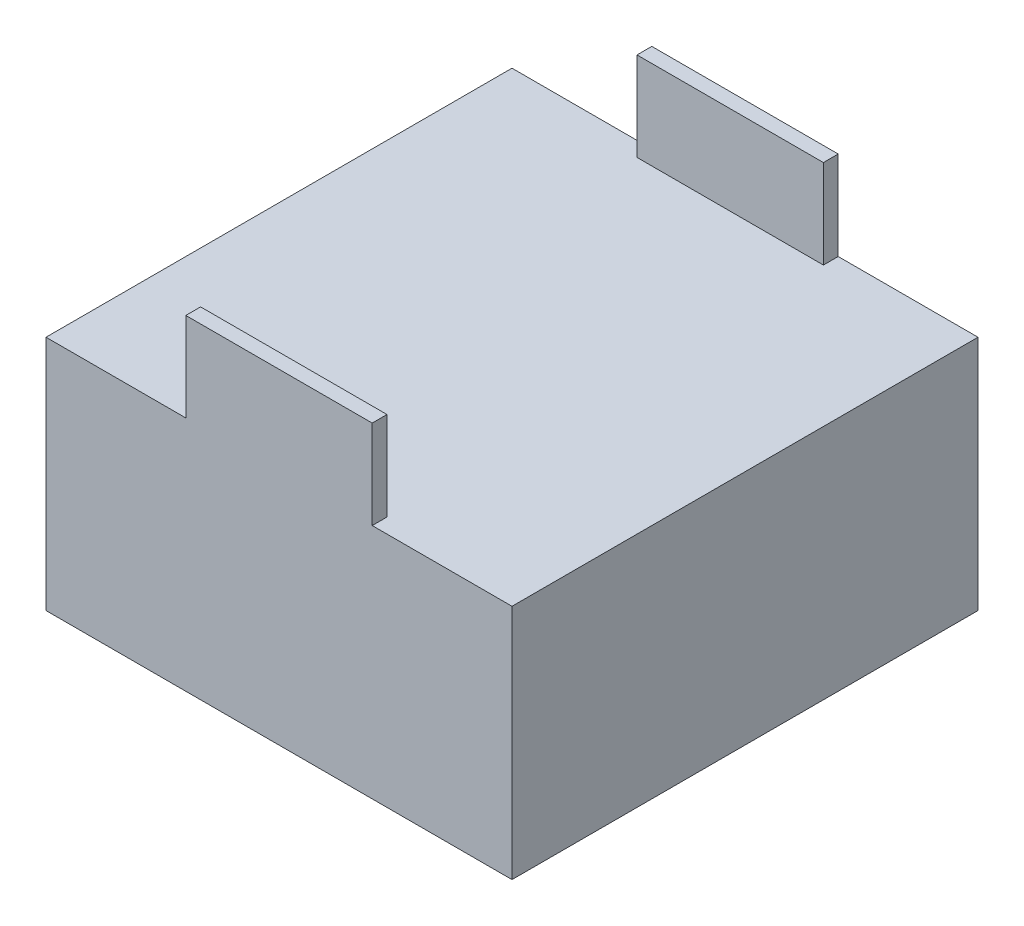
ISO-10303-21;
HEADER;
FILE_DESCRIPTION(('STEP AP214'),'2;1');
FILE_NAME('part.step','',(''),(''),'','','');
FILE_SCHEMA(('AUTOMOTIVE_DESIGN { 1 0 10303 214 1 1 1 1 }'));
ENDSEC;
DATA;
#1=APPLICATION_CONTEXT('core data for automotive mechanical design processes');
#2=APPLICATION_PROTOCOL_DEFINITION('international standard','automotive_design',2000,#1);
#3=PRODUCT_CONTEXT('',#1,'mechanical');
#4=PRODUCT('Part','Part','',(#3));
#5=PRODUCT_RELATED_PRODUCT_CATEGORY('part','',(#4));
#6=PRODUCT_DEFINITION_FORMATION('','',#4);
#7=PRODUCT_DEFINITION_CONTEXT('part definition',#1,'design');
#8=PRODUCT_DEFINITION('design','',#6,#7);
#9=PRODUCT_DEFINITION_SHAPE('','',#8);
#10=(LENGTH_UNIT() NAMED_UNIT(*) SI_UNIT(.MILLI.,.METRE.));
#11=(NAMED_UNIT(*) PLANE_ANGLE_UNIT() SI_UNIT($,.RADIAN.));
#12=(NAMED_UNIT(*) SI_UNIT($,.STERADIAN.) SOLID_ANGLE_UNIT());
#13=UNCERTAINTY_MEASURE_WITH_UNIT(LENGTH_MEASURE(1.E-05),#10,'distance_accuracy_value','');
#14=(GEOMETRIC_REPRESENTATION_CONTEXT(3) GLOBAL_UNCERTAINTY_ASSIGNED_CONTEXT((#13)) GLOBAL_UNIT_ASSIGNED_CONTEXT((#10,
#11,#12)) REPRESENTATION_CONTEXT('',''));
#15=CARTESIAN_POINT('',(0.,0.,0.));
#16=DIRECTION('',(0.,0.,1.));
#17=DIRECTION('',(1.,0.,0.));
#18=AXIS2_PLACEMENT_3D('',#15,#16,#17);
#19=CARTESIAN_POINT('',(0.,25.4,0.));
#20=DIRECTION('',(0.,-1.,0.));
#21=DIRECTION('',(0.,0.,-1.));
#22=AXIS2_PLACEMENT_3D('',#19,#20,#21);
#23=PLANE('',#22);
#24=DIRECTION('',(0.,0.,1.));
#25=VECTOR('',#24,1.);
#26=CARTESIAN_POINT('',(14.9999446,25.4,-49.9999));
#27=LINE('',#26,#25);
#28=CARTESIAN_POINT('',(14.9999446,25.4,-49.9999));
#29=VERTEX_POINT('',#28);
#30=CARTESIAN_POINT('',(14.9999446,25.4,-48.4124));
#31=VERTEX_POINT('',#30);
#32=EDGE_CURVE('E223',#29,#31,#27,.T.);
#33=ORIENTED_EDGE('',*,*,#32,.F.);
#34=DIRECTION('',(-1.,0.,0.));
#35=VECTOR('',#34,1.);
#36=CARTESIAN_POINT('',(0.,25.4,-49.9999));
#37=LINE('',#36,#35);
#38=CARTESIAN_POINT('',(0.,25.4,-49.9999));
#39=VERTEX_POINT('',#38);
#40=EDGE_CURVE('E146',#29,#39,#37,.T.);
#41=ORIENTED_EDGE('',*,*,#40,.T.);
#42=DIRECTION('',(0.,0.,1.));
#43=VECTOR('',#42,1.);
#44=CARTESIAN_POINT('',(0.,25.4,0.));
#45=LINE('',#44,#43);
#46=CARTESIAN_POINT('',(0.,25.4,0.));
#47=VERTEX_POINT('',#46);
#48=EDGE_CURVE('E174',#39,#47,#45,.T.);
#49=ORIENTED_EDGE('',*,*,#48,.T.);
#50=DIRECTION('',(1.,0.,0.));
#51=VECTOR('',#50,1.);
#52=CARTESIAN_POINT('',(0.,25.4,0.));
#53=LINE('',#52,#51);
#54=CARTESIAN_POINT('',(14.9999446,25.4,0.));
#55=VERTEX_POINT('',#54);
#56=EDGE_CURVE('E187',#47,#55,#53,.T.);
#57=ORIENTED_EDGE('',*,*,#56,.T.);
#58=DIRECTION('',(0.,0.,1.));
#59=VECTOR('',#58,1.);
#60=CARTESIAN_POINT('',(14.9999446,25.4,0.));
#61=LINE('',#60,#59);
#62=CARTESIAN_POINT('',(14.9999446,25.4,-1.5875));
#63=VERTEX_POINT('',#62);
#64=EDGE_CURVE('E37',#63,#55,#61,.T.);
#65=ORIENTED_EDGE('',*,*,#64,.F.);
#66=DIRECTION('',(-1.,0.,0.));
#67=VECTOR('',#66,1.);
#68=CARTESIAN_POINT('',(14.9999446,25.4,-1.5875));
#69=LINE('',#68,#67);
#70=CARTESIAN_POINT('',(34.9999554,25.4,-1.5875));
#71=VERTEX_POINT('',#70);
#72=EDGE_CURVE('E158',#71,#63,#69,.T.);
#73=ORIENTED_EDGE('',*,*,#72,.F.);
#74=DIRECTION('',(0.,0.,-1.));
#75=VECTOR('',#74,1.);
#76=CARTESIAN_POINT('',(34.9999554,25.4,0.));
#77=LINE('',#76,#75);
#78=CARTESIAN_POINT('',(34.9999554,25.4,0.));
#79=VERTEX_POINT('',#78);
#80=EDGE_CURVE('E149',#79,#71,#77,.T.);
#81=ORIENTED_EDGE('',*,*,#80,.F.);
#82=CARTESIAN_POINT('',(49.9999,25.4,0.));
#83=VERTEX_POINT('',#82);
#84=EDGE_CURVE('E177',#79,#83,#53,.T.);
#85=ORIENTED_EDGE('',*,*,#84,.T.);
#86=DIRECTION('',(0.,0.,-1.));
#87=VECTOR('',#86,1.);
#88=CARTESIAN_POINT('',(49.9999,25.4,0.));
#89=LINE('',#88,#87);
#90=CARTESIAN_POINT('',(49.9999,25.4,-49.9999));
#91=VERTEX_POINT('',#90);
#92=EDGE_CURVE('E181',#83,#91,#89,.T.);
#93=ORIENTED_EDGE('',*,*,#92,.T.);
#94=CARTESIAN_POINT('',(34.9999554,25.4,-49.9999));
#95=VERTEX_POINT('',#94);
#96=EDGE_CURVE('E197',#91,#95,#37,.T.);
#97=ORIENTED_EDGE('',*,*,#96,.T.);
#98=DIRECTION('',(0.,0.,-1.));
#99=VECTOR('',#98,1.);
#100=CARTESIAN_POINT('',(34.9999554,25.4,-49.9999));
#101=LINE('',#100,#99);
#102=CARTESIAN_POINT('',(34.9999554,25.4,-48.4124));
#103=VERTEX_POINT('',#102);
#104=EDGE_CURVE('E56',#103,#95,#101,.T.);
#105=ORIENTED_EDGE('',*,*,#104,.F.);
#106=DIRECTION('',(1.,0.,0.));
#107=VECTOR('',#106,1.);
#108=CARTESIAN_POINT('',(14.9999446,25.4,-48.4124));
#109=LINE('',#108,#107);
#110=EDGE_CURVE('E51',#31,#103,#109,.T.);
#111=ORIENTED_EDGE('',*,*,#110,.F.);
#112=EDGE_LOOP('',(#33,#41,#49,#57,#65,#73,#81,#85,#93,#97,#105,#111));
#113=FACE_BOUND('',#112,.T.);
#114=ADVANCED_FACE('F33',(#113),#23,.F.);
#115=CARTESIAN_POINT('',(0.,25.4,0.));
#116=DIRECTION('',(1.,0.,0.));
#117=DIRECTION('',(0.,0.,-1.));
#118=AXIS2_PLACEMENT_3D('',#115,#116,#117);
#119=PLANE('',#118);
#120=DIRECTION('',(0.,0.,1.));
#121=VECTOR('',#120,1.);
#122=CARTESIAN_POINT('',(0.,0.,0.));
#123=LINE('',#122,#121);
#124=CARTESIAN_POINT('',(0.,0.,-49.9999));
#125=VERTEX_POINT('',#124);
#126=CARTESIAN_POINT('',(0.,0.,0.));
#127=VERTEX_POINT('',#126);
#128=EDGE_CURVE('E203',#125,#127,#123,.T.);
#129=ORIENTED_EDGE('',*,*,#128,.T.);
#130=DIRECTION('',(0.,-1.,0.));
#131=VECTOR('',#130,1.);
#132=CARTESIAN_POINT('',(0.,25.4,0.));
#133=LINE('',#132,#131);
#134=EDGE_CURVE('E11',#47,#127,#133,.T.);
#135=ORIENTED_EDGE('',*,*,#134,.F.);
#136=ORIENTED_EDGE('',*,*,#48,.F.);
#137=DIRECTION('',(0.,-1.,0.));
#138=VECTOR('',#137,1.);
#139=CARTESIAN_POINT('',(0.,25.4,-49.9999));
#140=LINE('',#139,#138);
#141=EDGE_CURVE('E194',#39,#125,#140,.T.);
#142=ORIENTED_EDGE('',*,*,#141,.T.);
#143=EDGE_LOOP('',(#129,#135,#136,#142));
#144=FACE_BOUND('',#143,.T.);
#145=ADVANCED_FACE('F35',(#144),#119,.F.);
#146=CARTESIAN_POINT('',(0.,25.4,0.));
#147=DIRECTION('',(0.,0.,-1.));
#148=DIRECTION('',(-1.,0.,0.));
#149=AXIS2_PLACEMENT_3D('',#146,#147,#148);
#150=PLANE('',#149);
#151=DIRECTION('',(1.,0.,0.));
#152=VECTOR('',#151,1.);
#153=CARTESIAN_POINT('',(0.,0.,0.));
#154=LINE('',#153,#152);
#155=CARTESIAN_POINT('',(49.9999,0.,0.));
#156=VERTEX_POINT('',#155);
#157=EDGE_CURVE('E201',#127,#156,#154,.T.);
#158=ORIENTED_EDGE('',*,*,#157,.T.);
#159=DIRECTION('',(0.,-1.,0.));
#160=VECTOR('',#159,1.);
#161=CARTESIAN_POINT('',(49.9999,25.4,0.));
#162=LINE('',#161,#160);
#163=EDGE_CURVE('E43',#83,#156,#162,.T.);
#164=ORIENTED_EDGE('',*,*,#163,.F.);
#165=ORIENTED_EDGE('',*,*,#84,.F.);
#166=DIRECTION('',(0.,-1.,0.));
#167=VECTOR('',#166,1.);
#168=CARTESIAN_POINT('',(34.9999554,34.925,0.));
#169=LINE('',#168,#167);
#170=CARTESIAN_POINT('',(34.9999554,34.925,0.));
#171=VERTEX_POINT('',#170);
#172=EDGE_CURVE('E173',#171,#79,#169,.T.);
#173=ORIENTED_EDGE('',*,*,#172,.F.);
#174=DIRECTION('',(1.,0.,0.));
#175=VECTOR('',#174,1.);
#176=CARTESIAN_POINT('',(14.9999446,34.925,0.));
#177=LINE('',#176,#175);
#178=CARTESIAN_POINT('',(14.9999446,34.925,0.));
#179=VERTEX_POINT('',#178);
#180=EDGE_CURVE('E157',#179,#171,#177,.T.);
#181=ORIENTED_EDGE('',*,*,#180,.F.);
#182=DIRECTION('',(0.,-1.,0.));
#183=VECTOR('',#182,1.);
#184=CARTESIAN_POINT('',(14.9999446,34.925,0.));
#185=LINE('',#184,#183);
#186=EDGE_CURVE('E205',#179,#55,#185,.T.);
#187=ORIENTED_EDGE('',*,*,#186,.T.);
#188=ORIENTED_EDGE('',*,*,#56,.F.);
#189=ORIENTED_EDGE('',*,*,#134,.T.);
#190=EDGE_LOOP('',(#158,#164,#165,#173,#181,#187,#188,#189));
#191=FACE_BOUND('',#190,.T.);
#192=ADVANCED_FACE('F244',(#191),#150,.F.);
#193=CARTESIAN_POINT('',(49.9999,25.4,0.));
#194=DIRECTION('',(-1.,0.,0.));
#195=DIRECTION('',(0.,0.,1.));
#196=AXIS2_PLACEMENT_3D('',#193,#194,#195);
#197=PLANE('',#196);
#198=DIRECTION('',(0.,0.,-1.));
#199=VECTOR('',#198,1.);
#200=CARTESIAN_POINT('',(49.9999,0.,0.));
#201=LINE('',#200,#199);
#202=CARTESIAN_POINT('',(49.9999,0.,-49.9999));
#203=VERTEX_POINT('',#202);
#204=EDGE_CURVE('E199',#156,#203,#201,.T.);
#205=ORIENTED_EDGE('',*,*,#204,.T.);
#206=DIRECTION('',(0.,-1.,0.));
#207=VECTOR('',#206,1.);
#208=CARTESIAN_POINT('',(49.9999,25.4,-49.9999));
#209=LINE('',#208,#207);
#210=EDGE_CURVE('E191',#91,#203,#209,.T.);
#211=ORIENTED_EDGE('',*,*,#210,.F.);
#212=ORIENTED_EDGE('',*,*,#92,.F.);
#213=ORIENTED_EDGE('',*,*,#163,.T.);
#214=EDGE_LOOP('',(#205,#211,#212,#213));
#215=FACE_BOUND('',#214,.T.);
#216=ADVANCED_FACE('F212',(#215),#197,.F.);
#217=CARTESIAN_POINT('',(0.,25.4,-49.9999));
#218=DIRECTION('',(0.,0.,1.));
#219=DIRECTION('',(1.,0.,0.));
#220=AXIS2_PLACEMENT_3D('',#217,#218,#219);
#221=PLANE('',#220);
#222=DIRECTION('',(-1.,0.,0.));
#223=VECTOR('',#222,1.);
#224=CARTESIAN_POINT('',(0.,0.,-49.9999));
#225=LINE('',#224,#223);
#226=EDGE_CURVE('E178',#203,#125,#225,.T.);
#227=ORIENTED_EDGE('',*,*,#226,.T.);
#228=ORIENTED_EDGE('',*,*,#141,.F.);
#229=ORIENTED_EDGE('',*,*,#40,.F.);
#230=DIRECTION('',(0.,-1.,0.));
#231=VECTOR('',#230,1.);
#232=CARTESIAN_POINT('',(14.9999446,34.925,-49.9999));
#233=LINE('',#232,#231);
#234=CARTESIAN_POINT('',(14.9999446,34.925,-49.9999));
#235=VERTEX_POINT('',#234);
#236=EDGE_CURVE('E128',#235,#29,#233,.T.);
#237=ORIENTED_EDGE('',*,*,#236,.F.);
#238=DIRECTION('',(-1.,0.,0.));
#239=VECTOR('',#238,1.);
#240=CARTESIAN_POINT('',(14.9999446,34.925,-49.9999));
#241=LINE('',#240,#239);
#242=CARTESIAN_POINT('',(34.9999554,34.925,-49.9999));
#243=VERTEX_POINT('',#242);
#244=EDGE_CURVE('E134',#243,#235,#241,.T.);
#245=ORIENTED_EDGE('',*,*,#244,.F.);
#246=DIRECTION('',(0.,-1.,0.));
#247=VECTOR('',#246,1.);
#248=CARTESIAN_POINT('',(34.9999554,34.925,-49.9999));
#249=LINE('',#248,#247);
#250=EDGE_CURVE('E215',#243,#95,#249,.T.);
#251=ORIENTED_EDGE('',*,*,#250,.T.);
#252=ORIENTED_EDGE('',*,*,#96,.F.);
#253=ORIENTED_EDGE('',*,*,#210,.T.);
#254=EDGE_LOOP('',(#227,#228,#229,#237,#245,#251,#252,#253));
#255=FACE_BOUND('',#254,.T.);
#256=ADVANCED_FACE('F144',(#255),#221,.F.);
#257=CARTESIAN_POINT('',(0.,0.,0.));
#258=DIRECTION('',(0.,-1.,0.));
#259=DIRECTION('',(0.,0.,-1.));
#260=AXIS2_PLACEMENT_3D('',#257,#258,#259);
#261=PLANE('',#260);
#262=ORIENTED_EDGE('',*,*,#128,.F.);
#263=ORIENTED_EDGE('',*,*,#226,.F.);
#264=ORIENTED_EDGE('',*,*,#204,.F.);
#265=ORIENTED_EDGE('',*,*,#157,.F.);
#266=EDGE_LOOP('',(#262,#263,#264,#265));
#267=FACE_BOUND('',#266,.T.);
#268=ADVANCED_FACE('F250',(#267),#261,.T.);
#269=CARTESIAN_POINT('',(14.9999446,34.925,0.));
#270=DIRECTION('',(1.,0.,0.));
#271=DIRECTION('',(0.,0.,-1.));
#272=AXIS2_PLACEMENT_3D('',#269,#270,#271);
#273=PLANE('',#272);
#274=ORIENTED_EDGE('',*,*,#64,.T.);
#275=ORIENTED_EDGE('',*,*,#186,.F.);
#276=DIRECTION('',(0.,0.,1.));
#277=VECTOR('',#276,1.);
#278=CARTESIAN_POINT('',(14.9999446,34.925,0.));
#279=LINE('',#278,#277);
#280=CARTESIAN_POINT('',(14.9999446,34.925,-1.5875));
#281=VERTEX_POINT('',#280);
#282=EDGE_CURVE('E154',#281,#179,#279,.T.);
#283=ORIENTED_EDGE('',*,*,#282,.F.);
#284=DIRECTION('',(0.,-1.,0.));
#285=VECTOR('',#284,1.);
#286=CARTESIAN_POINT('',(14.9999446,34.925,-1.5875));
#287=LINE('',#286,#285);
#288=EDGE_CURVE('E163',#281,#63,#287,.T.);
#289=ORIENTED_EDGE('',*,*,#288,.T.);
#290=EDGE_LOOP('',(#274,#275,#283,#289));
#291=FACE_BOUND('',#290,.T.);
#292=ADVANCED_FACE('F248',(#291),#273,.F.);
#293=CARTESIAN_POINT('',(34.9999554,34.925,0.));
#294=DIRECTION('',(-1.,0.,0.));
#295=DIRECTION('',(0.,0.,1.));
#296=AXIS2_PLACEMENT_3D('',#293,#294,#295);
#297=PLANE('',#296);
#298=ORIENTED_EDGE('',*,*,#80,.T.);
#299=DIRECTION('',(0.,-1.,0.));
#300=VECTOR('',#299,1.);
#301=CARTESIAN_POINT('',(34.9999554,34.925,-1.5875));
#302=LINE('',#301,#300);
#303=CARTESIAN_POINT('',(34.9999554,34.925,-1.5875));
#304=VERTEX_POINT('',#303);
#305=EDGE_CURVE('E170',#304,#71,#302,.T.);
#306=ORIENTED_EDGE('',*,*,#305,.F.);
#307=DIRECTION('',(0.,0.,-1.));
#308=VECTOR('',#307,1.);
#309=CARTESIAN_POINT('',(34.9999554,34.925,0.));
#310=LINE('',#309,#308);
#311=EDGE_CURVE('E160',#171,#304,#310,.T.);
#312=ORIENTED_EDGE('',*,*,#311,.F.);
#313=ORIENTED_EDGE('',*,*,#172,.T.);
#314=EDGE_LOOP('',(#298,#306,#312,#313));
#315=FACE_BOUND('',#314,.T.);
#316=ADVANCED_FACE('F277',(#315),#297,.F.);
#317=CARTESIAN_POINT('',(14.9999446,34.925,-1.5875));
#318=DIRECTION('',(0.,0.,1.));
#319=DIRECTION('',(1.,0.,0.));
#320=AXIS2_PLACEMENT_3D('',#317,#318,#319);
#321=PLANE('',#320);
#322=ORIENTED_EDGE('',*,*,#72,.T.);
#323=ORIENTED_EDGE('',*,*,#288,.F.);
#324=DIRECTION('',(-1.,0.,0.));
#325=VECTOR('',#324,1.);
#326=CARTESIAN_POINT('',(14.9999446,34.925,-1.5875));
#327=LINE('',#326,#325);
#328=EDGE_CURVE('E162',#304,#281,#327,.T.);
#329=ORIENTED_EDGE('',*,*,#328,.F.);
#330=ORIENTED_EDGE('',*,*,#305,.T.);
#331=EDGE_LOOP('',(#322,#323,#329,#330));
#332=FACE_BOUND('',#331,.T.);
#333=ADVANCED_FACE('F272',(#332),#321,.F.);
#334=CARTESIAN_POINT('',(0.,34.925,0.));
#335=DIRECTION('',(0.,-1.,0.));
#336=DIRECTION('',(0.,0.,-1.));
#337=AXIS2_PLACEMENT_3D('',#334,#335,#336);
#338=PLANE('',#337);
#339=ORIENTED_EDGE('',*,*,#282,.T.);
#340=ORIENTED_EDGE('',*,*,#180,.T.);
#341=ORIENTED_EDGE('',*,*,#311,.T.);
#342=ORIENTED_EDGE('',*,*,#328,.T.);
#343=EDGE_LOOP('',(#339,#340,#341,#342));
#344=FACE_BOUND('',#343,.T.);
#345=ADVANCED_FACE('F286',(#344),#338,.F.);
#346=CARTESIAN_POINT('',(14.9999446,34.925,-49.9999));
#347=DIRECTION('',(1.,0.,0.));
#348=DIRECTION('',(0.,0.,-1.));
#349=AXIS2_PLACEMENT_3D('',#346,#347,#348);
#350=PLANE('',#349);
#351=ORIENTED_EDGE('',*,*,#32,.T.);
#352=DIRECTION('',(0.,-1.,0.));
#353=VECTOR('',#352,1.);
#354=CARTESIAN_POINT('',(14.9999446,34.925,-48.4124));
#355=LINE('',#354,#353);
#356=CARTESIAN_POINT('',(14.9999446,34.925,-48.4124));
#357=VERTEX_POINT('',#356);
#358=EDGE_CURVE('E130',#357,#31,#355,.T.);
#359=ORIENTED_EDGE('',*,*,#358,.F.);
#360=DIRECTION('',(0.,0.,1.));
#361=VECTOR('',#360,1.);
#362=CARTESIAN_POINT('',(14.9999446,34.925,-49.9999));
#363=LINE('',#362,#361);
#364=EDGE_CURVE('E124',#235,#357,#363,.T.);
#365=ORIENTED_EDGE('',*,*,#364,.F.);
#366=ORIENTED_EDGE('',*,*,#236,.T.);
#367=EDGE_LOOP('',(#351,#359,#365,#366));
#368=FACE_BOUND('',#367,.T.);
#369=ADVANCED_FACE('F126',(#368),#350,.F.);
#370=CARTESIAN_POINT('',(14.9999446,34.925,-48.4124));
#371=DIRECTION('',(0.,0.,-1.));
#372=DIRECTION('',(-1.,0.,0.));
#373=AXIS2_PLACEMENT_3D('',#370,#371,#372);
#374=PLANE('',#373);
#375=ORIENTED_EDGE('',*,*,#110,.T.);
#376=DIRECTION('',(0.,-1.,0.));
#377=VECTOR('',#376,1.);
#378=CARTESIAN_POINT('',(34.9999554,34.925,-48.4124));
#379=LINE('',#378,#377);
#380=CARTESIAN_POINT('',(34.9999554,34.925,-48.4124));
#381=VERTEX_POINT('',#380);
#382=EDGE_CURVE('E150',#381,#103,#379,.T.);
#383=ORIENTED_EDGE('',*,*,#382,.F.);
#384=DIRECTION('',(1.,0.,0.));
#385=VECTOR('',#384,1.);
#386=CARTESIAN_POINT('',(14.9999446,34.925,-48.4124));
#387=LINE('',#386,#385);
#388=EDGE_CURVE('E133',#357,#381,#387,.T.);
#389=ORIENTED_EDGE('',*,*,#388,.F.);
#390=ORIENTED_EDGE('',*,*,#358,.T.);
#391=EDGE_LOOP('',(#375,#383,#389,#390));
#392=FACE_BOUND('',#391,.T.);
#393=ADVANCED_FACE('F227',(#392),#374,.F.);
#394=CARTESIAN_POINT('',(34.9999554,34.925,-49.9999));
#395=DIRECTION('',(-1.,0.,0.));
#396=DIRECTION('',(0.,0.,1.));
#397=AXIS2_PLACEMENT_3D('',#394,#395,#396);
#398=PLANE('',#397);
#399=ORIENTED_EDGE('',*,*,#104,.T.);
#400=ORIENTED_EDGE('',*,*,#250,.F.);
#401=DIRECTION('',(0.,0.,-1.));
#402=VECTOR('',#401,1.);
#403=CARTESIAN_POINT('',(34.9999554,34.925,-49.9999));
#404=LINE('',#403,#402);
#405=EDGE_CURVE('E139',#381,#243,#404,.T.);
#406=ORIENTED_EDGE('',*,*,#405,.F.);
#407=ORIENTED_EDGE('',*,*,#382,.T.);
#408=EDGE_LOOP('',(#399,#400,#406,#407));
#409=FACE_BOUND('',#408,.T.);
#410=ADVANCED_FACE('F228',(#409),#398,.F.);
#411=CARTESIAN_POINT('',(0.,34.925,0.));
#412=DIRECTION('',(0.,-1.,0.));
#413=DIRECTION('',(0.,0.,-1.));
#414=AXIS2_PLACEMENT_3D('',#411,#412,#413);
#415=PLANE('',#414);
#416=ORIENTED_EDGE('',*,*,#244,.T.);
#417=ORIENTED_EDGE('',*,*,#364,.T.);
#418=ORIENTED_EDGE('',*,*,#388,.T.);
#419=ORIENTED_EDGE('',*,*,#405,.T.);
#420=EDGE_LOOP('',(#416,#417,#418,#419));
#421=FACE_BOUND('',#420,.T.);
#422=ADVANCED_FACE('F137',(#421),#415,.F.);
#423=CLOSED_SHELL('',(#114,#145,#192,#216,#256,#268,#292,#316,#333,#345,#369,#393,#410,#422));
#424=MANIFOLD_SOLID_BREP('B2',#423);
#425=ADVANCED_BREP_SHAPE_REPRESENTATION('',(#18,#424),#14);
#426=SHAPE_DEFINITION_REPRESENTATION(#9,#425);
ENDSEC;
END-ISO-10303-21;
